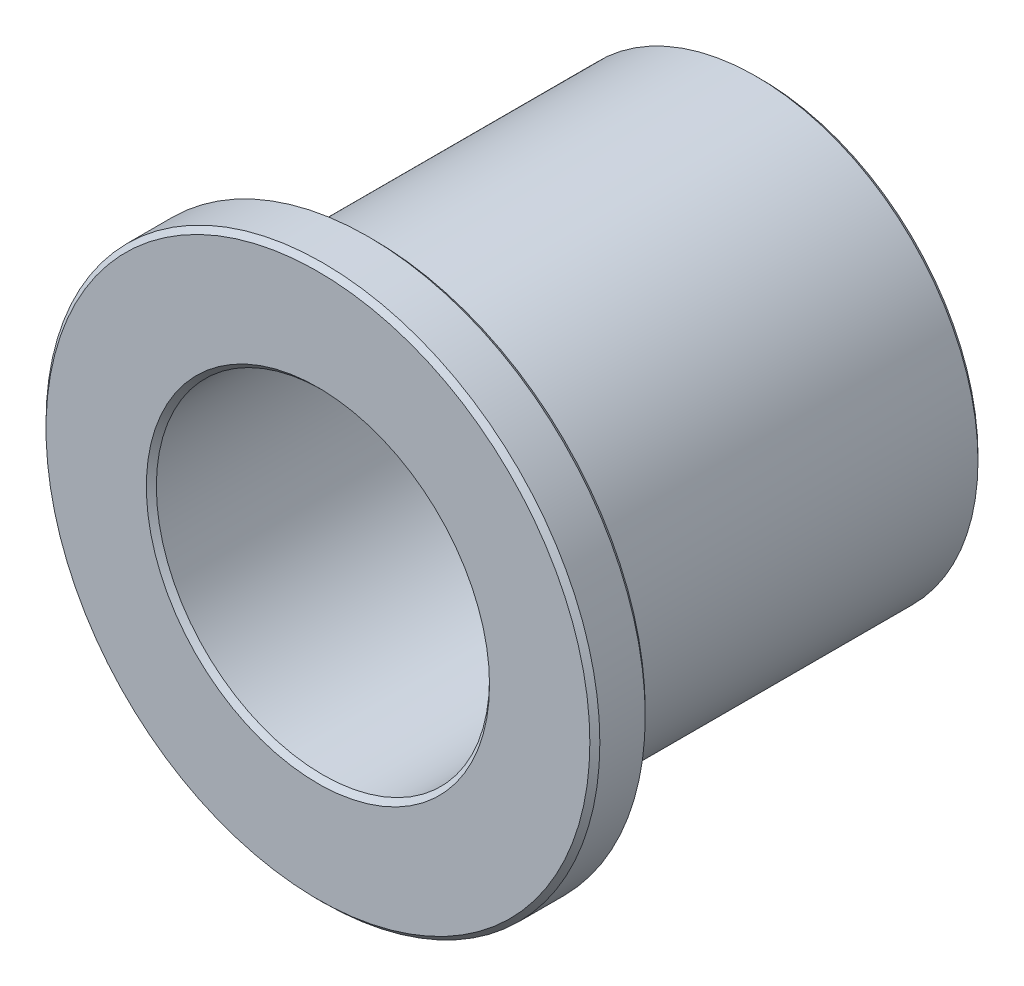
ISO-10303-21;
HEADER;
FILE_DESCRIPTION(('STEP AP214'),'2;1');
FILE_NAME('part.step','',(''),(''),'','','');
FILE_SCHEMA(('AUTOMOTIVE_DESIGN { 1 0 10303 214 1 1 1 1 }'));
ENDSEC;
DATA;
#1=APPLICATION_CONTEXT('core data for automotive mechanical design processes');
#2=APPLICATION_PROTOCOL_DEFINITION('international standard','automotive_design',2000,#1);
#3=PRODUCT_CONTEXT('',#1,'mechanical');
#4=PRODUCT('Part','Part','',(#3));
#5=PRODUCT_RELATED_PRODUCT_CATEGORY('part','',(#4));
#6=PRODUCT_DEFINITION_FORMATION('','',#4);
#7=PRODUCT_DEFINITION_CONTEXT('part definition',#1,'design');
#8=PRODUCT_DEFINITION('design','',#6,#7);
#9=PRODUCT_DEFINITION_SHAPE('','',#8);
#10=(LENGTH_UNIT() NAMED_UNIT(*) SI_UNIT(.MILLI.,.METRE.));
#11=(NAMED_UNIT(*) PLANE_ANGLE_UNIT() SI_UNIT($,.RADIAN.));
#12=(NAMED_UNIT(*) SI_UNIT($,.STERADIAN.) SOLID_ANGLE_UNIT());
#13=UNCERTAINTY_MEASURE_WITH_UNIT(LENGTH_MEASURE(1.E-05),#10,'distance_accuracy_value','');
#14=(GEOMETRIC_REPRESENTATION_CONTEXT(3) GLOBAL_UNCERTAINTY_ASSIGNED_CONTEXT((#13)) GLOBAL_UNIT_ASSIGNED_CONTEXT((#10,
#11,#12)) REPRESENTATION_CONTEXT('',''));
#15=CARTESIAN_POINT('',(0.,0.,0.));
#16=DIRECTION('',(0.,0.,1.));
#17=DIRECTION('',(1.,0.,0.));
#18=AXIS2_PLACEMENT_3D('',#15,#16,#17);
#19=CARTESIAN_POINT('',(0.,0.,4.7625));
#20=DIRECTION('',(0.,0.,1.));
#21=DIRECTION('',(1.,0.,0.));
#22=AXIS2_PLACEMENT_3D('',#19,#20,#21);
#23=CYLINDRICAL_SURFACE('',#22,7.9375);
#24=CARTESIAN_POINT('',(0.,0.,6.20674400000001));
#25=DIRECTION('',(0.,0.,1.));
#26=DIRECTION('',(1.,0.,0.));
#27=AXIS2_PLACEMENT_3D('',#24,#25,#26);
#28=CIRCLE('',#27,7.9375);
#29=CARTESIAN_POINT('',(7.9375,0.,6.20674400000001));
#30=VERTEX_POINT('',#29);
#31=EDGE_CURVE('E61',#30,#30,#28,.F.);
#32=ORIENTED_EDGE('',*,*,#31,.T.);
#33=EDGE_LOOP('',(#32));
#34=FACE_BOUND('',#33,.T.);
#35=CARTESIAN_POINT('',(0.,0.,4.905756));
#36=DIRECTION('',(0.,0.,1.));
#37=DIRECTION('',(1.,0.,0.));
#38=AXIS2_PLACEMENT_3D('',#35,#36,#37);
#39=CIRCLE('',#38,7.9375);
#40=CARTESIAN_POINT('',(7.9375,0.,4.905756));
#41=VERTEX_POINT('',#40);
#42=EDGE_CURVE('E64',#41,#41,#39,.T.);
#43=ORIENTED_EDGE('',*,*,#42,.T.);
#44=EDGE_LOOP('',(#43));
#45=FACE_BOUND('',#44,.T.);
#46=ADVANCED_FACE('F35',(#34,#45),#23,.T.);
#47=CARTESIAN_POINT('',(0.,0.,4.7625));
#48=DIRECTION('',(0.,0.,1.));
#49=DIRECTION('',(1.,0.,0.));
#50=AXIS2_PLACEMENT_3D('',#47,#48,#49);
#51=PLANE('',#50);
#52=CARTESIAN_POINT('',(0.,0.,4.7625));
#53=DIRECTION('',(0.,0.,1.));
#54=DIRECTION('',(1.,0.,0.));
#55=AXIS2_PLACEMENT_3D('',#52,#53,#54);
#56=CIRCLE('',#55,7.794244);
#57=CARTESIAN_POINT('',(7.794244,0.,4.7625));
#58=VERTEX_POINT('',#57);
#59=EDGE_CURVE('E55',#58,#58,#56,.F.);
#60=ORIENTED_EDGE('',*,*,#59,.T.);
#61=EDGE_LOOP('',(#60));
#62=FACE_BOUND('',#61,.T.);
#63=CARTESIAN_POINT('',(0.,0.,4.7625));
#64=DIRECTION('',(0.,0.,1.));
#65=DIRECTION('',(1.,0.,0.));
#66=AXIS2_PLACEMENT_3D('',#63,#64,#65);
#67=CIRCLE('',#66,6.505956);
#68=CARTESIAN_POINT('',(6.505956,0.,4.7625));
#69=VERTEX_POINT('',#68);
#70=EDGE_CURVE('E58',#69,#69,#67,.T.);
#71=ORIENTED_EDGE('',*,*,#70,.T.);
#72=EDGE_LOOP('',(#71));
#73=FACE_BOUND('',#72,.T.);
#74=ADVANCED_FACE('F95',(#62,#73),#51,.F.);
#75=CARTESIAN_POINT('',(0.,0.,6.35));
#76=DIRECTION('',(0.,0.,1.));
#77=DIRECTION('',(1.,0.,0.));
#78=AXIS2_PLACEMENT_3D('',#75,#76,#77);
#79=PLANE('',#78);
#80=CARTESIAN_POINT('',(0.,0.,6.35));
#81=DIRECTION('',(0.,0.,1.));
#82=DIRECTION('',(1.,0.,0.));
#83=AXIS2_PLACEMENT_3D('',#80,#81,#82);
#84=CIRCLE('',#83,4.91845600000001);
#85=CARTESIAN_POINT('',(4.91845600000001,0.,6.35));
#86=VERTEX_POINT('',#85);
#87=EDGE_CURVE('E67',#86,#86,#84,.F.);
#88=ORIENTED_EDGE('',*,*,#87,.T.);
#89=EDGE_LOOP('',(#88));
#90=FACE_BOUND('',#89,.T.);
#91=CARTESIAN_POINT('',(0.,0.,6.35));
#92=DIRECTION('',(0.,0.,1.));
#93=DIRECTION('',(1.,0.,0.));
#94=AXIS2_PLACEMENT_3D('',#91,#92,#93);
#95=CIRCLE('',#94,7.79424400000001);
#96=CARTESIAN_POINT('',(7.79424400000001,0.,6.35));
#97=VERTEX_POINT('',#96);
#98=EDGE_CURVE('E70',#97,#97,#95,.T.);
#99=ORIENTED_EDGE('',*,*,#98,.T.);
#100=EDGE_LOOP('',(#99));
#101=FACE_BOUND('',#100,.T.);
#102=ADVANCED_FACE('F101',(#90,#101),#79,.T.);
#103=CARTESIAN_POINT('',(0.,0.,4.7625));
#104=DIRECTION('',(0.,0.,1.));
#105=DIRECTION('',(1.,0.,0.));
#106=AXIS2_PLACEMENT_3D('',#103,#104,#105);
#107=CYLINDRICAL_SURFACE('',#106,4.7752);
#108=CARTESIAN_POINT('',(0.,0.,6.206744));
#109=DIRECTION('',(0.,0.,1.));
#110=DIRECTION('',(1.,0.,0.));
#111=AXIS2_PLACEMENT_3D('',#108,#109,#110);
#112=CIRCLE('',#111,4.7752);
#113=CARTESIAN_POINT('',(4.7752,0.,6.206744));
#114=VERTEX_POINT('',#113);
#115=EDGE_CURVE('E73',#114,#114,#112,.T.);
#116=ORIENTED_EDGE('',*,*,#115,.T.);
#117=EDGE_LOOP('',(#116));
#118=FACE_BOUND('',#117,.T.);
#119=CARTESIAN_POINT('',(0.,0.,-6.206744));
#120=DIRECTION('',(0.,0.,1.));
#121=DIRECTION('',(1.,0.,0.));
#122=AXIS2_PLACEMENT_3D('',#119,#120,#121);
#123=CIRCLE('',#122,4.7752);
#124=CARTESIAN_POINT('',(4.7752,0.,-6.206744));
#125=VERTEX_POINT('',#124);
#126=EDGE_CURVE('E76',#125,#125,#123,.F.);
#127=ORIENTED_EDGE('',*,*,#126,.T.);
#128=EDGE_LOOP('',(#127));
#129=FACE_BOUND('',#128,.T.);
#130=ADVANCED_FACE('F80',(#118,#129),#107,.F.);
#131=CARTESIAN_POINT('',(0.,0.,-6.35));
#132=DIRECTION('',(0.,0.,1.));
#133=DIRECTION('',(1.,0.,0.));
#134=AXIS2_PLACEMENT_3D('',#131,#132,#133);
#135=CYLINDRICAL_SURFACE('',#134,6.3627);
#136=CARTESIAN_POINT('',(0.,0.,4.619244));
#137=DIRECTION('',(0.,0.,1.));
#138=DIRECTION('',(1.,0.,0.));
#139=AXIS2_PLACEMENT_3D('',#136,#137,#138);
#140=CIRCLE('',#139,6.3627);
#141=CARTESIAN_POINT('',(6.3627,0.,4.619244));
#142=VERTEX_POINT('',#141);
#143=EDGE_CURVE('E46',#142,#142,#140,.F.);
#144=ORIENTED_EDGE('',*,*,#143,.T.);
#145=EDGE_LOOP('',(#144));
#146=FACE_BOUND('',#145,.T.);
#147=CARTESIAN_POINT('',(0.,0.,-6.206744));
#148=DIRECTION('',(0.,0.,1.));
#149=DIRECTION('',(1.,0.,0.));
#150=AXIS2_PLACEMENT_3D('',#147,#148,#149);
#151=CIRCLE('',#150,6.3627);
#152=CARTESIAN_POINT('',(6.3627,0.,-6.206744));
#153=VERTEX_POINT('',#152);
#154=EDGE_CURVE('E50',#153,#153,#151,.T.);
#155=ORIENTED_EDGE('',*,*,#154,.T.);
#156=EDGE_LOOP('',(#155));
#157=FACE_BOUND('',#156,.T.);
#158=ADVANCED_FACE('F163',(#146,#157),#135,.T.);
#159=CARTESIAN_POINT('',(0.,0.,-6.35));
#160=DIRECTION('',(0.,0.,1.));
#161=DIRECTION('',(1.,0.,0.));
#162=AXIS2_PLACEMENT_3D('',#159,#160,#161);
#163=PLANE('',#162);
#164=CARTESIAN_POINT('',(0.,0.,-6.35));
#165=DIRECTION('',(0.,0.,1.));
#166=DIRECTION('',(1.,0.,0.));
#167=AXIS2_PLACEMENT_3D('',#164,#165,#166);
#168=CIRCLE('',#167,4.918456);
#169=CARTESIAN_POINT('',(4.918456,0.,-6.35));
#170=VERTEX_POINT('',#169);
#171=EDGE_CURVE('E10',#170,#170,#168,.T.);
#172=ORIENTED_EDGE('',*,*,#171,.T.);
#173=EDGE_LOOP('',(#172));
#174=FACE_BOUND('',#173,.T.);
#175=CARTESIAN_POINT('',(0.,0.,-6.35));
#176=DIRECTION('',(0.,0.,1.));
#177=DIRECTION('',(1.,0.,0.));
#178=AXIS2_PLACEMENT_3D('',#175,#176,#177);
#179=CIRCLE('',#178,6.219444);
#180=CARTESIAN_POINT('',(6.219444,0.,-6.35));
#181=VERTEX_POINT('',#180);
#182=EDGE_CURVE('E42',#181,#181,#179,.F.);
#183=ORIENTED_EDGE('',*,*,#182,.T.);
#184=EDGE_LOOP('',(#183));
#185=FACE_BOUND('',#184,.T.);
#186=ADVANCED_FACE('F111',(#174,#185),#163,.F.);
#187=CARTESIAN_POINT('',(0.,0.,6.206744));
#188=DIRECTION('',(0.,0.,1.));
#189=DIRECTION('',(1.,0.,0.));
#190=AXIS2_PLACEMENT_3D('',#187,#188,#189);
#191=CONICAL_SURFACE('',#190,4.7752,0.785398163397457);
#192=ORIENTED_EDGE('',*,*,#87,.F.);
#193=EDGE_LOOP('',(#192));
#194=FACE_BOUND('',#193,.T.);
#195=ORIENTED_EDGE('',*,*,#115,.F.);
#196=EDGE_LOOP('',(#195));
#197=FACE_BOUND('',#196,.T.);
#198=ADVANCED_FACE('F107',(#194,#197),#191,.F.);
#199=CARTESIAN_POINT('',(0.,0.,6.35));
#200=DIRECTION('',(0.,0.,-1.));
#201=DIRECTION('',(-1.,0.,0.));
#202=AXIS2_PLACEMENT_3D('',#199,#200,#201);
#203=CONICAL_SURFACE('',#202,7.79424400000001,0.78539816339746);
#204=ORIENTED_EDGE('',*,*,#31,.F.);
#205=EDGE_LOOP('',(#204));
#206=FACE_BOUND('',#205,.T.);
#207=ORIENTED_EDGE('',*,*,#98,.F.);
#208=EDGE_LOOP('',(#207));
#209=FACE_BOUND('',#208,.T.);
#210=ADVANCED_FACE('F110',(#206,#209),#203,.T.);
#211=CARTESIAN_POINT('',(0.,0.,4.905756));
#212=DIRECTION('',(0.,0.,1.));
#213=DIRECTION('',(1.,0.,0.));
#214=AXIS2_PLACEMENT_3D('',#211,#212,#213);
#215=CONICAL_SURFACE('',#214,7.9375,0.785398163397454);
#216=ORIENTED_EDGE('',*,*,#59,.F.);
#217=EDGE_LOOP('',(#216));
#218=FACE_BOUND('',#217,.T.);
#219=ORIENTED_EDGE('',*,*,#42,.F.);
#220=EDGE_LOOP('',(#219));
#221=FACE_BOUND('',#220,.T.);
#222=ADVANCED_FACE('F91',(#218,#221),#215,.T.);
#223=CARTESIAN_POINT('',(0.,0.,4.7625));
#224=DIRECTION('',(0.,0.,1.));
#225=DIRECTION('',(1.,0.,0.));
#226=AXIS2_PLACEMENT_3D('',#223,#224,#225);
#227=CONICAL_SURFACE('',#226,6.505956,0.785398163397454);
#228=ORIENTED_EDGE('',*,*,#143,.F.);
#229=EDGE_LOOP('',(#228));
#230=FACE_BOUND('',#229,.T.);
#231=ORIENTED_EDGE('',*,*,#70,.F.);
#232=EDGE_LOOP('',(#231));
#233=FACE_BOUND('',#232,.T.);
#234=ADVANCED_FACE('F85',(#230,#233),#227,.T.);
#235=CARTESIAN_POINT('',(0.,0.,-6.35));
#236=DIRECTION('',(0.,0.,-1.));
#237=DIRECTION('',(-1.,0.,0.));
#238=AXIS2_PLACEMENT_3D('',#235,#236,#237);
#239=CONICAL_SURFACE('',#238,4.918456,0.785398163397442);
#240=ORIENTED_EDGE('',*,*,#126,.F.);
#241=EDGE_LOOP('',(#240));
#242=FACE_BOUND('',#241,.T.);
#243=ORIENTED_EDGE('',*,*,#171,.F.);
#244=EDGE_LOOP('',(#243));
#245=FACE_BOUND('',#244,.T.);
#246=ADVANCED_FACE('F82',(#242,#245),#239,.F.);
#247=CARTESIAN_POINT('',(0.,0.,-6.206744));
#248=DIRECTION('',(0.,0.,1.));
#249=DIRECTION('',(1.,0.,0.));
#250=AXIS2_PLACEMENT_3D('',#247,#248,#249);
#251=CONICAL_SURFACE('',#250,6.3627,0.785398163397454);
#252=CARTESIAN_POINT('',(6.219444,0.,-6.35));
#253=CARTESIAN_POINT('',(6.22093625,0.,-6.34850775));
#254=CARTESIAN_POINT('',(6.2224285,0.,-6.3470155));
#255=CARTESIAN_POINT('',(6.225413,0.,-6.344031));
#256=CARTESIAN_POINT('',(6.22690525,0.,-6.34253875));
#257=CARTESIAN_POINT('',(6.22988975,0.,-6.33955425));
#258=CARTESIAN_POINT('',(6.231382,0.,-6.338062));
#259=CARTESIAN_POINT('',(6.2343665,0.,-6.3350775));
#260=CARTESIAN_POINT('',(6.23585875,0.,-6.33358525));
#261=CARTESIAN_POINT('',(6.23884325,0.,-6.33060075));
#262=CARTESIAN_POINT('',(6.2403355,0.,-6.3291085));
#263=CARTESIAN_POINT('',(6.24332,0.,-6.326124));
#264=CARTESIAN_POINT('',(6.24481225,0.,-6.32463175));
#265=CARTESIAN_POINT('',(6.24779675,0.,-6.32164725));
#266=CARTESIAN_POINT('',(6.249289,0.,-6.320155));
#267=CARTESIAN_POINT('',(6.2522735,0.,-6.3171705));
#268=CARTESIAN_POINT('',(6.25376575,0.,-6.31567825));
#269=CARTESIAN_POINT('',(6.25675025,0.,-6.31269375));
#270=CARTESIAN_POINT('',(6.2582425,0.,-6.3112015));
#271=CARTESIAN_POINT('',(6.261227,0.,-6.308217));
#272=CARTESIAN_POINT('',(6.26271925,0.,-6.30672475));
#273=CARTESIAN_POINT('',(6.26570375,0.,-6.30374025));
#274=CARTESIAN_POINT('',(6.267196,0.,-6.302248));
#275=CARTESIAN_POINT('',(6.2701805,0.,-6.2992635));
#276=CARTESIAN_POINT('',(6.27167275,0.,-6.29777125));
#277=CARTESIAN_POINT('',(6.27465725,0.,-6.29478675));
#278=CARTESIAN_POINT('',(6.2761495,0.,-6.2932945));
#279=CARTESIAN_POINT('',(6.279134,0.,-6.29031));
#280=CARTESIAN_POINT('',(6.28062625,0.,-6.28881775));
#281=CARTESIAN_POINT('',(6.28361075,0.,-6.28583325));
#282=CARTESIAN_POINT('',(6.285103,0.,-6.284341));
#283=CARTESIAN_POINT('',(6.2880875,0.,-6.2813565));
#284=CARTESIAN_POINT('',(6.28957975,0.,-6.27986425));
#285=CARTESIAN_POINT('',(6.29256425,0.,-6.27687975));
#286=CARTESIAN_POINT('',(6.2940565,0.,-6.2753875));
#287=CARTESIAN_POINT('',(6.297041,0.,-6.272403));
#288=CARTESIAN_POINT('',(6.29853325,0.,-6.27091075));
#289=CARTESIAN_POINT('',(6.30151775,0.,-6.26792625));
#290=CARTESIAN_POINT('',(6.30301,0.,-6.266434));
#291=CARTESIAN_POINT('',(6.3059945,0.,-6.2634495));
#292=CARTESIAN_POINT('',(6.30748675,0.,-6.26195725));
#293=CARTESIAN_POINT('',(6.31047125,0.,-6.25897275));
#294=CARTESIAN_POINT('',(6.3119635,0.,-6.2574805));
#295=CARTESIAN_POINT('',(6.314948,0.,-6.254496));
#296=CARTESIAN_POINT('',(6.31644025,0.,-6.25300375));
#297=CARTESIAN_POINT('',(6.31942475,0.,-6.25001925));
#298=CARTESIAN_POINT('',(6.320917,0.,-6.248527));
#299=CARTESIAN_POINT('',(6.3239015,0.,-6.2455425));
#300=CARTESIAN_POINT('',(6.32539375,0.,-6.24405025));
#301=CARTESIAN_POINT('',(6.32837825,0.,-6.24106575));
#302=CARTESIAN_POINT('',(6.3298705,0.,-6.2395735));
#303=CARTESIAN_POINT('',(6.332855,0.,-6.236589));
#304=CARTESIAN_POINT('',(6.33434725,0.,-6.23509675));
#305=CARTESIAN_POINT('',(6.33733175,0.,-6.23211225));
#306=CARTESIAN_POINT('',(6.338824,0.,-6.23062));
#307=CARTESIAN_POINT('',(6.3418085,0.,-6.2276355));
#308=CARTESIAN_POINT('',(6.34330075,0.,-6.22614325));
#309=CARTESIAN_POINT('',(6.34628525,0.,-6.22315875));
#310=CARTESIAN_POINT('',(6.3477775,0.,-6.2216665));
#311=CARTESIAN_POINT('',(6.350762,0.,-6.218682));
#312=CARTESIAN_POINT('',(6.35225425,0.,-6.21718975));
#313=CARTESIAN_POINT('',(6.35523875,0.,-6.21420525));
#314=CARTESIAN_POINT('',(6.356731,0.,-6.212713));
#315=CARTESIAN_POINT('',(6.3597155,0.,-6.2097285));
#316=CARTESIAN_POINT('',(6.36120775,0.,-6.20823625));
#317=CARTESIAN_POINT('',(6.3627,0.,-6.206744));
#318=B_SPLINE_CURVE_WITH_KNOTS('',3,(#252,#253,#254,#255,#256,#257,#258,#259,#260,#261,#262,
#263,#264,#265,#266,#267,#268,#269,#270,#271,#272,#273,#274,#275,#276,#277,#278,#279,#280,#281,
#282,#283,#284,#285,#286,#287,#288,#289,#290,#291,#292,#293,#294,#295,#296,#297,#298,#299,#300,
#301,#302,#303,#304,#305,#306,#307,#308,#309,#310,#311,#312,#313,#314,#315,#316,#317),
.UNSPECIFIED.,.F.,.F.,(4,2,2,2,2,2,2,2,2,2,2,2,2,2,2,2,2,2,2,2,2,2,2,2,2,2,2,2,2,2,2,2,4),(0.,
0.00633108056535412,0.0126621611307082,0.0189932416960624,0.0253243222614152,0.0316554028267694,
0.0379864833921235,0.044317563957477,0.0506486445228305,0.0569797250881846,0.0633108056535381,
0.0696418862188922,0.0759729667842457,0.0823040473495992,0.0886351279149533,0.0949662084803075,
0.10129728904566,0.107628369611014,0.113959450176369,0.120290530741723,0.126621611307076,
0.13295269187243,0.139283772437784,0.145614853003137,0.151945933568491,0.158277014133845,
0.164608094699198,0.170939175264553,0.177270255829907,0.18360133639526,0.189932416960614,
0.196263497525968,0.202594578091321),.UNSPECIFIED.);
#319=EDGE_CURVE('BSEAM37',#181,#153,#318,.T.);
#320=ORIENTED_EDGE('',*,*,#182,.F.);
#321=ORIENTED_EDGE('',*,*,#154,.F.);
#322=ORIENTED_EDGE('',*,*,#319,.T.);
#323=ORIENTED_EDGE('',*,*,#319,.F.);
#324=EDGE_LOOP('',(#320,#322,#321,#323));
#325=FACE_BOUND('',#324,.T.);
#326=ADVANCED_FACE('F37',(#325),#251,.T.);
#327=CLOSED_SHELL('',(#46,#74,#102,#130,#158,#186,#198,#210,#222,#234,#246,#326));
#328=MANIFOLD_SOLID_BREP('B2',#327);
#329=ADVANCED_BREP_SHAPE_REPRESENTATION('',(#18,#328),#14);
#330=SHAPE_DEFINITION_REPRESENTATION(#9,#329);
ENDSEC;
END-ISO-10303-21;
